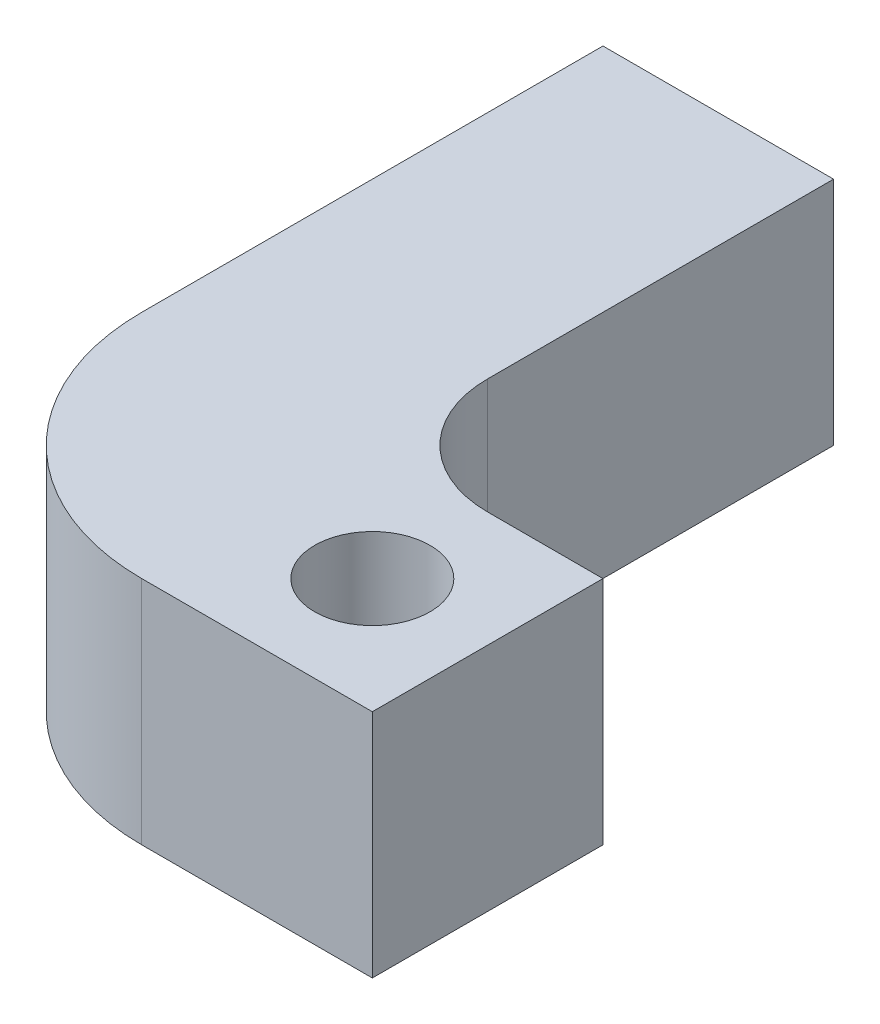
ISO-10303-21;
HEADER;
FILE_DESCRIPTION(('STEP AP214'),'2;1');
FILE_NAME('part.step','',(''),(''),'','','');
FILE_SCHEMA(('AUTOMOTIVE_DESIGN { 1 0 10303 214 1 1 1 1 }'));
ENDSEC;
DATA;
#1=APPLICATION_CONTEXT('core data for automotive mechanical design processes');
#2=APPLICATION_PROTOCOL_DEFINITION('international standard','automotive_design',2000,#1);
#3=PRODUCT_CONTEXT('',#1,'mechanical');
#4=PRODUCT('Part','Part','',(#3));
#5=PRODUCT_RELATED_PRODUCT_CATEGORY('part','',(#4));
#6=PRODUCT_DEFINITION_FORMATION('','',#4);
#7=PRODUCT_DEFINITION_CONTEXT('part definition',#1,'design');
#8=PRODUCT_DEFINITION('design','',#6,#7);
#9=PRODUCT_DEFINITION_SHAPE('','',#8);
#10=(LENGTH_UNIT() NAMED_UNIT(*) SI_UNIT(.MILLI.,.METRE.));
#11=(NAMED_UNIT(*) PLANE_ANGLE_UNIT() SI_UNIT($,.RADIAN.));
#12=(NAMED_UNIT(*) SI_UNIT($,.STERADIAN.) SOLID_ANGLE_UNIT());
#13=UNCERTAINTY_MEASURE_WITH_UNIT(LENGTH_MEASURE(1.E-05),#10,'distance_accuracy_value','');
#14=(GEOMETRIC_REPRESENTATION_CONTEXT(3) GLOBAL_UNCERTAINTY_ASSIGNED_CONTEXT((#13)) GLOBAL_UNIT_ASSIGNED_CONTEXT((#10,
#11,#12)) REPRESENTATION_CONTEXT('',''));
#15=CARTESIAN_POINT('',(0.,0.,0.));
#16=DIRECTION('',(0.,0.,1.));
#17=DIRECTION('',(1.,0.,0.));
#18=AXIS2_PLACEMENT_3D('',#15,#16,#17);
#19=CARTESIAN_POINT('',(0.,10.,30.));
#20=DIRECTION('',(0.,0.,-1.));
#21=DIRECTION('',(-1.,0.,0.));
#22=AXIS2_PLACEMENT_3D('',#19,#20,#21);
#23=PLANE('',#22);
#24=DIRECTION('',(1.,0.,0.));
#25=VECTOR('',#24,1.);
#26=CARTESIAN_POINT('',(0.,10.,30.));
#27=LINE('',#26,#25);
#28=CARTESIAN_POINT('',(10.,10.,30.));
#29=VERTEX_POINT('',#28);
#30=CARTESIAN_POINT('',(20.,10.,30.));
#31=VERTEX_POINT('',#30);
#32=EDGE_CURVE('E101',#29,#31,#27,.T.);
#33=ORIENTED_EDGE('',*,*,#32,.F.);
#34=DIRECTION('',(0.,-1.,0.));
#35=VECTOR('',#34,1.);
#36=CARTESIAN_POINT('',(10.,10.,30.));
#37=LINE('',#36,#35);
#38=CARTESIAN_POINT('',(10.,0.,30.));
#39=VERTEX_POINT('',#38);
#40=EDGE_CURVE('E127',#29,#39,#37,.T.);
#41=ORIENTED_EDGE('',*,*,#40,.T.);
#42=DIRECTION('',(1.,0.,0.));
#43=VECTOR('',#42,1.);
#44=CARTESIAN_POINT('',(0.,0.,30.));
#45=LINE('',#44,#43);
#46=CARTESIAN_POINT('',(20.,0.,30.));
#47=VERTEX_POINT('',#46);
#48=EDGE_CURVE('E125',#39,#47,#45,.T.);
#49=ORIENTED_EDGE('',*,*,#48,.T.);
#50=DIRECTION('',(0.,-1.,0.));
#51=VECTOR('',#50,1.);
#52=CARTESIAN_POINT('',(20.,10.,30.));
#53=LINE('',#52,#51);
#54=EDGE_CURVE('E119',#31,#47,#53,.T.);
#55=ORIENTED_EDGE('',*,*,#54,.F.);
#56=EDGE_LOOP('',(#33,#41,#49,#55));
#57=FACE_BOUND('',#56,.T.);
#58=ADVANCED_FACE('F37',(#57),#23,.F.);
#59=CARTESIAN_POINT('',(20.,10.,0.));
#60=DIRECTION('',(-1.,0.,0.));
#61=DIRECTION('',(0.,0.,1.));
#62=AXIS2_PLACEMENT_3D('',#59,#60,#61);
#63=PLANE('',#62);
#64=DIRECTION('',(0.,0.,-1.));
#65=VECTOR('',#64,1.);
#66=CARTESIAN_POINT('',(20.,0.,0.));
#67=LINE('',#66,#65);
#68=CARTESIAN_POINT('',(20.,0.,20.));
#69=VERTEX_POINT('',#68);
#70=EDGE_CURVE('E152',#47,#69,#67,.T.);
#71=ORIENTED_EDGE('',*,*,#70,.T.);
#72=DIRECTION('',(0.,-1.,0.));
#73=VECTOR('',#72,1.);
#74=CARTESIAN_POINT('',(20.,10.,20.));
#75=LINE('',#74,#73);
#76=CARTESIAN_POINT('',(20.,10.,20.));
#77=VERTEX_POINT('',#76);
#78=EDGE_CURVE('E121',#77,#69,#75,.T.);
#79=ORIENTED_EDGE('',*,*,#78,.F.);
#80=DIRECTION('',(0.,0.,-1.));
#81=VECTOR('',#80,1.);
#82=CARTESIAN_POINT('',(20.,10.,0.));
#83=LINE('',#82,#81);
#84=EDGE_CURVE('E105',#31,#77,#83,.T.);
#85=ORIENTED_EDGE('',*,*,#84,.F.);
#86=ORIENTED_EDGE('',*,*,#54,.T.);
#87=EDGE_LOOP('',(#71,#79,#85,#86));
#88=FACE_BOUND('',#87,.T.);
#89=ADVANCED_FACE('F118',(#88),#63,.F.);
#90=CARTESIAN_POINT('',(0.,10.,20.));
#91=DIRECTION('',(0.,0.,-1.));
#92=DIRECTION('',(-1.,0.,0.));
#93=AXIS2_PLACEMENT_3D('',#90,#91,#92);
#94=PLANE('',#93);
#95=DIRECTION('',(1.,0.,0.));
#96=VECTOR('',#95,1.);
#97=CARTESIAN_POINT('',(0.,0.,20.));
#98=LINE('',#97,#96);
#99=CARTESIAN_POINT('',(15.,0.,20.));
#100=VERTEX_POINT('',#99);
#101=EDGE_CURVE('E145',#100,#69,#98,.T.);
#102=ORIENTED_EDGE('',*,*,#101,.F.);
#103=DIRECTION('',(0.,-1.,0.));
#104=VECTOR('',#103,1.);
#105=CARTESIAN_POINT('',(15.,10.,20.));
#106=LINE('',#105,#104);
#107=CARTESIAN_POINT('',(15.,10.,20.));
#108=VERTEX_POINT('',#107);
#109=EDGE_CURVE('E58',#100,#108,#106,.F.);
#110=ORIENTED_EDGE('',*,*,#109,.T.);
#111=DIRECTION('',(1.,0.,0.));
#112=VECTOR('',#111,1.);
#113=CARTESIAN_POINT('',(0.,10.,20.));
#114=LINE('',#113,#112);
#115=EDGE_CURVE('E122',#108,#77,#114,.T.);
#116=ORIENTED_EDGE('',*,*,#115,.T.);
#117=ORIENTED_EDGE('',*,*,#78,.T.);
#118=EDGE_LOOP('',(#102,#110,#116,#117));
#119=FACE_BOUND('',#118,.T.);
#120=ADVANCED_FACE('F151',(#119),#94,.T.);
#121=CARTESIAN_POINT('',(10.,10.,0.));
#122=DIRECTION('',(1.,0.,0.));
#123=DIRECTION('',(0.,0.,-1.));
#124=AXIS2_PLACEMENT_3D('',#121,#122,#123);
#125=PLANE('',#124);
#126=DIRECTION('',(0.,0.,1.));
#127=VECTOR('',#126,1.);
#128=CARTESIAN_POINT('',(10.,10.,0.));
#129=LINE('',#128,#127);
#130=CARTESIAN_POINT('',(10.,10.,0.));
#131=VERTEX_POINT('',#130);
#132=CARTESIAN_POINT('',(10.,10.,15.));
#133=VERTEX_POINT('',#132);
#134=EDGE_CURVE('E156',#131,#133,#129,.T.);
#135=ORIENTED_EDGE('',*,*,#134,.T.);
#136=DIRECTION('',(0.,-1.,0.));
#137=VECTOR('',#136,1.);
#138=CARTESIAN_POINT('',(10.,0.,15.));
#139=LINE('',#138,#137);
#140=CARTESIAN_POINT('',(10.,0.,15.));
#141=VERTEX_POINT('',#140);
#142=EDGE_CURVE('E139',#133,#141,#139,.T.);
#143=ORIENTED_EDGE('',*,*,#142,.T.);
#144=DIRECTION('',(0.,0.,1.));
#145=VECTOR('',#144,1.);
#146=CARTESIAN_POINT('',(10.,0.,0.));
#147=LINE('',#146,#145);
#148=CARTESIAN_POINT('',(10.,0.,0.));
#149=VERTEX_POINT('',#148);
#150=EDGE_CURVE('E148',#149,#141,#147,.T.);
#151=ORIENTED_EDGE('',*,*,#150,.F.);
#152=DIRECTION('',(0.,-1.,0.));
#153=VECTOR('',#152,1.);
#154=CARTESIAN_POINT('',(10.,10.,0.));
#155=LINE('',#154,#153);
#156=EDGE_CURVE('E131',#131,#149,#155,.T.);
#157=ORIENTED_EDGE('',*,*,#156,.F.);
#158=EDGE_LOOP('',(#135,#143,#151,#157));
#159=FACE_BOUND('',#158,.T.);
#160=ADVANCED_FACE('F155',(#159),#125,.T.);
#161=CARTESIAN_POINT('',(0.,10.,0.));
#162=DIRECTION('',(0.,0.,-1.));
#163=DIRECTION('',(-1.,0.,0.));
#164=AXIS2_PLACEMENT_3D('',#161,#162,#163);
#165=PLANE('',#164);
#166=DIRECTION('',(1.,0.,0.));
#167=VECTOR('',#166,1.);
#168=CARTESIAN_POINT('',(0.,0.,0.));
#169=LINE('',#168,#167);
#170=CARTESIAN_POINT('',(0.,0.,0.));
#171=VERTEX_POINT('',#170);
#172=EDGE_CURVE('E171',#171,#149,#169,.T.);
#173=ORIENTED_EDGE('',*,*,#172,.F.);
#174=DIRECTION('',(0.,-1.,0.));
#175=VECTOR('',#174,1.);
#176=CARTESIAN_POINT('',(0.,10.,0.));
#177=LINE('',#176,#175);
#178=CARTESIAN_POINT('',(0.,10.,0.));
#179=VERTEX_POINT('',#178);
#180=EDGE_CURVE('E166',#179,#171,#177,.T.);
#181=ORIENTED_EDGE('',*,*,#180,.F.);
#182=DIRECTION('',(1.,0.,0.));
#183=VECTOR('',#182,1.);
#184=CARTESIAN_POINT('',(0.,10.,0.));
#185=LINE('',#184,#183);
#186=EDGE_CURVE('E159',#179,#131,#185,.T.);
#187=ORIENTED_EDGE('',*,*,#186,.T.);
#188=ORIENTED_EDGE('',*,*,#156,.T.);
#189=EDGE_LOOP('',(#173,#181,#187,#188));
#190=FACE_BOUND('',#189,.T.);
#191=ADVANCED_FACE('F177',(#190),#165,.T.);
#192=CARTESIAN_POINT('',(0.,10.,0.));
#193=DIRECTION('',(1.,0.,0.));
#194=DIRECTION('',(0.,0.,-1.));
#195=AXIS2_PLACEMENT_3D('',#192,#193,#194);
#196=PLANE('',#195);
#197=DIRECTION('',(0.,0.,1.));
#198=VECTOR('',#197,1.);
#199=CARTESIAN_POINT('',(0.,0.,0.));
#200=LINE('',#199,#198);
#201=CARTESIAN_POINT('',(0.,0.,20.));
#202=VERTEX_POINT('',#201);
#203=EDGE_CURVE('E113',#171,#202,#200,.T.);
#204=ORIENTED_EDGE('',*,*,#203,.T.);
#205=DIRECTION('',(0.,-1.,0.));
#206=VECTOR('',#205,1.);
#207=CARTESIAN_POINT('',(0.,10.,20.));
#208=LINE('',#207,#206);
#209=CARTESIAN_POINT('',(0.,10.,20.));
#210=VERTEX_POINT('',#209);
#211=EDGE_CURVE('E136',#202,#210,#208,.F.);
#212=ORIENTED_EDGE('',*,*,#211,.T.);
#213=DIRECTION('',(0.,0.,1.));
#214=VECTOR('',#213,1.);
#215=CARTESIAN_POINT('',(0.,10.,0.));
#216=LINE('',#215,#214);
#217=EDGE_CURVE('E161',#179,#210,#216,.T.);
#218=ORIENTED_EDGE('',*,*,#217,.F.);
#219=ORIENTED_EDGE('',*,*,#180,.T.);
#220=EDGE_LOOP('',(#204,#212,#218,#219));
#221=FACE_BOUND('',#220,.T.);
#222=ADVANCED_FACE('F184',(#221),#196,.F.);
#223=CARTESIAN_POINT('',(0.,10.,0.));
#224=DIRECTION('',(0.,1.,0.));
#225=DIRECTION('',(0.,0.,1.));
#226=AXIS2_PLACEMENT_3D('',#223,#224,#225);
#227=PLANE('',#226);
#228=CARTESIAN_POINT('',(15.,10.,25.));
#229=DIRECTION('',(0.,1.,0.));
#230=DIRECTION('',(0.,0.,1.));
#231=AXIS2_PLACEMENT_3D('',#228,#229,#230);
#232=CIRCLE('',#231,2.5);
#233=CARTESIAN_POINT('',(15.,10.,27.5));
#234=VERTEX_POINT('',#233);
#235=EDGE_CURVE('E221',#234,#234,#232,.T.);
#236=ORIENTED_EDGE('',*,*,#235,.F.);
#237=EDGE_LOOP('',(#236));
#238=FACE_BOUND('',#237,.T.);
#239=ORIENTED_EDGE('',*,*,#217,.T.);
#240=CARTESIAN_POINT('',(10.,10.,20.));
#241=DIRECTION('',(0.,1.,0.));
#242=DIRECTION('',(0.,0.,1.));
#243=AXIS2_PLACEMENT_3D('',#240,#241,#242);
#244=CIRCLE('',#243,10.);
#245=EDGE_CURVE('E108',#210,#29,#244,.T.);
#246=ORIENTED_EDGE('',*,*,#245,.T.);
#247=ORIENTED_EDGE('',*,*,#32,.T.);
#248=ORIENTED_EDGE('',*,*,#84,.T.);
#249=ORIENTED_EDGE('',*,*,#115,.F.);
#250=CARTESIAN_POINT('',(15.,10.,15.));
#251=DIRECTION('',(0.,1.,0.));
#252=DIRECTION('',(0.,0.,1.));
#253=AXIS2_PLACEMENT_3D('',#250,#251,#252);
#254=CIRCLE('',#253,5.);
#255=EDGE_CURVE('E12',#108,#133,#254,.F.);
#256=ORIENTED_EDGE('',*,*,#255,.T.);
#257=ORIENTED_EDGE('',*,*,#134,.F.);
#258=ORIENTED_EDGE('',*,*,#186,.F.);
#259=EDGE_LOOP('',(#239,#246,#247,#248,#249,#256,#257,#258));
#260=FACE_BOUND('',#259,.T.);
#261=ADVANCED_FACE('F104',(#238,#260),#227,.T.);
#262=CARTESIAN_POINT('',(0.,0.,0.));
#263=DIRECTION('',(0.,1.,0.));
#264=DIRECTION('',(0.,0.,1.));
#265=AXIS2_PLACEMENT_3D('',#262,#263,#264);
#266=PLANE('',#265);
#267=CARTESIAN_POINT('',(15.,0.,25.));
#268=DIRECTION('',(0.,1.,0.));
#269=DIRECTION('',(0.,0.,1.));
#270=AXIS2_PLACEMENT_3D('',#267,#268,#269);
#271=CIRCLE('',#270,2.5);
#272=CARTESIAN_POINT('',(15.,0.,27.5));
#273=VERTEX_POINT('',#272);
#274=EDGE_CURVE('E168',#273,#273,#271,.T.);
#275=ORIENTED_EDGE('',*,*,#274,.T.);
#276=EDGE_LOOP('',(#275));
#277=FACE_BOUND('',#276,.T.);
#278=ORIENTED_EDGE('',*,*,#48,.F.);
#279=CARTESIAN_POINT('',(10.,0.,20.));
#280=DIRECTION('',(0.,1.,0.));
#281=DIRECTION('',(0.,0.,1.));
#282=AXIS2_PLACEMENT_3D('',#279,#280,#281);
#283=CIRCLE('',#282,10.);
#284=EDGE_CURVE('E129',#39,#202,#283,.F.);
#285=ORIENTED_EDGE('',*,*,#284,.T.);
#286=ORIENTED_EDGE('',*,*,#203,.F.);
#287=ORIENTED_EDGE('',*,*,#172,.T.);
#288=ORIENTED_EDGE('',*,*,#150,.T.);
#289=CARTESIAN_POINT('',(15.,0.,15.));
#290=DIRECTION('',(0.,1.,0.));
#291=DIRECTION('',(0.,0.,1.));
#292=AXIS2_PLACEMENT_3D('',#289,#290,#291);
#293=CIRCLE('',#292,5.);
#294=EDGE_CURVE('E45',#141,#100,#293,.T.);
#295=ORIENTED_EDGE('',*,*,#294,.T.);
#296=ORIENTED_EDGE('',*,*,#101,.T.);
#297=ORIENTED_EDGE('',*,*,#70,.F.);
#298=EDGE_LOOP('',(#278,#285,#286,#287,#288,#295,#296,#297));
#299=FACE_BOUND('',#298,.T.);
#300=ADVANCED_FACE('F144',(#277,#299),#266,.F.);
#301=CARTESIAN_POINT('',(10.,10.,20.));
#302=DIRECTION('',(0.,-1.,0.));
#303=DIRECTION('',(0.,0.,-1.));
#304=AXIS2_PLACEMENT_3D('',#301,#302,#303);
#305=CYLINDRICAL_SURFACE('',#304,10.);
#306=ORIENTED_EDGE('',*,*,#245,.F.);
#307=ORIENTED_EDGE('',*,*,#211,.F.);
#308=ORIENTED_EDGE('',*,*,#284,.F.);
#309=ORIENTED_EDGE('',*,*,#40,.F.);
#310=EDGE_LOOP('',(#306,#307,#308,#309));
#311=FACE_BOUND('',#310,.T.);
#312=ADVANCED_FACE('F182',(#311),#305,.T.);
#313=CARTESIAN_POINT('',(15.,10.,15.));
#314=DIRECTION('',(0.,1.,0.));
#315=DIRECTION('',(0.,0.,1.));
#316=AXIS2_PLACEMENT_3D('',#313,#314,#315);
#317=CYLINDRICAL_SURFACE('',#316,5.);
#318=ORIENTED_EDGE('',*,*,#255,.F.);
#319=ORIENTED_EDGE('',*,*,#109,.F.);
#320=ORIENTED_EDGE('',*,*,#294,.F.);
#321=ORIENTED_EDGE('',*,*,#142,.F.);
#322=EDGE_LOOP('',(#318,#319,#320,#321));
#323=FACE_BOUND('',#322,.T.);
#324=ADVANCED_FACE('F39',(#323),#317,.F.);
#325=CARTESIAN_POINT('',(15.,0.,25.));
#326=DIRECTION('',(0.,1.,0.));
#327=DIRECTION('',(0.,0.,1.));
#328=AXIS2_PLACEMENT_3D('',#325,#326,#327);
#329=CYLINDRICAL_SURFACE('',#328,2.5);
#330=ORIENTED_EDGE('',*,*,#274,.F.);
#331=EDGE_LOOP('',(#330));
#332=FACE_BOUND('',#331,.T.);
#333=ORIENTED_EDGE('',*,*,#235,.T.);
#334=EDGE_LOOP('',(#333));
#335=FACE_BOUND('',#334,.T.);
#336=ADVANCED_FACE('F207',(#332,#335),#329,.F.);
#337=CLOSED_SHELL('',(#58,#89,#120,#160,#191,#222,#261,#300,#312,#324,#336));
#338=MANIFOLD_SOLID_BREP('B2',#337);
#339=ADVANCED_BREP_SHAPE_REPRESENTATION('',(#18,#338),#14);
#340=SHAPE_DEFINITION_REPRESENTATION(#9,#339);
ENDSEC;
END-ISO-10303-21;
